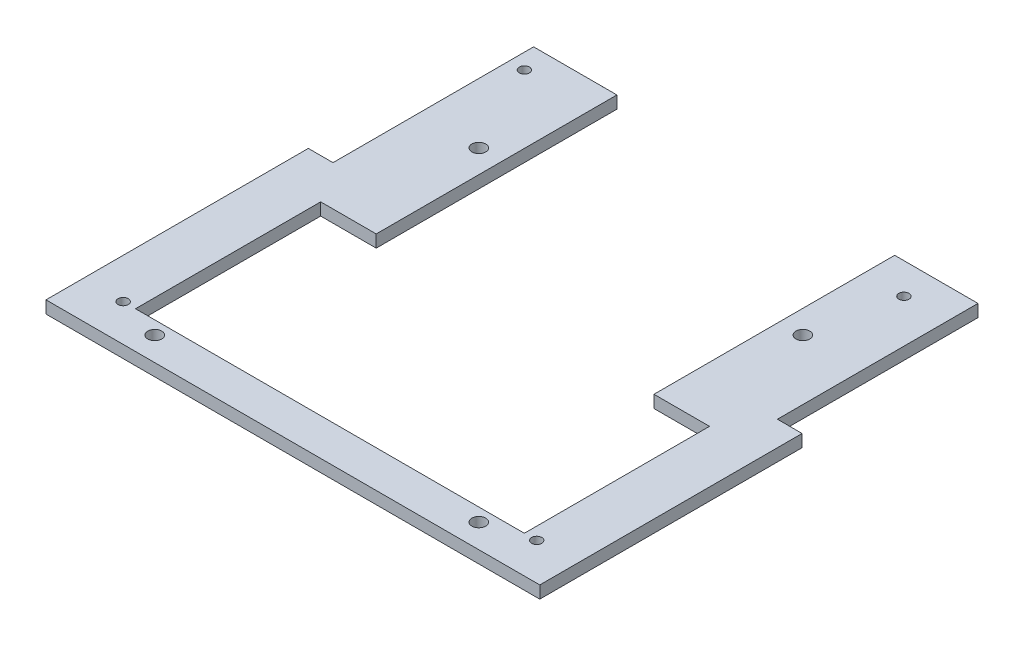
ISO-10303-21;
HEADER;
FILE_DESCRIPTION(('STEP AP214'),'2;1');
FILE_NAME('part.step','',(''),(''),'','','');
FILE_SCHEMA(('AUTOMOTIVE_DESIGN { 1 0 10303 214 1 1 1 1 }'));
ENDSEC;
DATA;
#1=APPLICATION_CONTEXT('core data for automotive mechanical design processes');
#2=APPLICATION_PROTOCOL_DEFINITION('international standard','automotive_design',2000,#1);
#3=PRODUCT_CONTEXT('',#1,'mechanical');
#4=PRODUCT('Part','Part','',(#3));
#5=PRODUCT_RELATED_PRODUCT_CATEGORY('part','',(#4));
#6=PRODUCT_DEFINITION_FORMATION('','',#4);
#7=PRODUCT_DEFINITION_CONTEXT('part definition',#1,'design');
#8=PRODUCT_DEFINITION('design','',#6,#7);
#9=PRODUCT_DEFINITION_SHAPE('','',#8);
#10=(LENGTH_UNIT() NAMED_UNIT(*) SI_UNIT(.MILLI.,.METRE.));
#11=(NAMED_UNIT(*) PLANE_ANGLE_UNIT() SI_UNIT($,.RADIAN.));
#12=(NAMED_UNIT(*) SI_UNIT($,.STERADIAN.) SOLID_ANGLE_UNIT());
#13=UNCERTAINTY_MEASURE_WITH_UNIT(LENGTH_MEASURE(1.E-05),#10,'distance_accuracy_value','');
#14=(GEOMETRIC_REPRESENTATION_CONTEXT(3) GLOBAL_UNCERTAINTY_ASSIGNED_CONTEXT((#13)) GLOBAL_UNIT_ASSIGNED_CONTEXT((#10,
#11,#12)) REPRESENTATION_CONTEXT('',''));
#15=CARTESIAN_POINT('',(0.,0.,0.));
#16=DIRECTION('',(0.,0.,1.));
#17=DIRECTION('',(1.,0.,0.));
#18=AXIS2_PLACEMENT_3D('',#15,#16,#17);
#19=CARTESIAN_POINT('',(72.,4.,0.));
#20=DIRECTION('',(1.,0.,0.));
#21=DIRECTION('',(0.,0.,-1.));
#22=AXIS2_PLACEMENT_3D('',#19,#20,#21);
#23=PLANE('',#22);
#24=DIRECTION('',(0.,0.,1.));
#25=VECTOR('',#24,1.);
#26=CARTESIAN_POINT('',(72.,0.,0.));
#27=LINE('',#26,#25);
#28=CARTESIAN_POINT('',(72.,0.,-75.));
#29=VERTEX_POINT('',#28);
#30=CARTESIAN_POINT('',(72.,0.,-10.));
#31=VERTEX_POINT('',#30);
#32=EDGE_CURVE('E216',#29,#31,#27,.T.);
#33=ORIENTED_EDGE('',*,*,#32,.F.);
#34=DIRECTION('',(0.,-1.,0.));
#35=VECTOR('',#34,1.);
#36=CARTESIAN_POINT('',(72.,4.,-75.));
#37=LINE('',#36,#35);
#38=CARTESIAN_POINT('',(72.,4.,-75.));
#39=VERTEX_POINT('',#38);
#40=EDGE_CURVE('E11',#39,#29,#37,.T.);
#41=ORIENTED_EDGE('',*,*,#40,.F.);
#42=DIRECTION('',(0.,0.,1.));
#43=VECTOR('',#42,1.);
#44=CARTESIAN_POINT('',(72.,4.,0.));
#45=LINE('',#44,#43);
#46=CARTESIAN_POINT('',(72.,4.,-10.));
#47=VERTEX_POINT('',#46);
#48=EDGE_CURVE('E409',#39,#47,#45,.T.);
#49=ORIENTED_EDGE('',*,*,#48,.T.);
#50=DIRECTION('',(0.,-1.,0.));
#51=VECTOR('',#50,1.);
#52=CARTESIAN_POINT('',(72.,4.,-10.));
#53=LINE('',#52,#51);
#54=EDGE_CURVE('E110',#47,#31,#53,.T.);
#55=ORIENTED_EDGE('',*,*,#54,.T.);
#56=EDGE_LOOP('',(#33,#41,#49,#55));
#57=FACE_BOUND('',#56,.T.);
#58=ADVANCED_FACE('F35',(#57),#23,.T.);
#59=CARTESIAN_POINT('',(0.,4.,-75.));
#60=DIRECTION('',(0.,0.,-1.));
#61=DIRECTION('',(-1.,0.,0.));
#62=AXIS2_PLACEMENT_3D('',#59,#60,#61);
#63=PLANE('',#62);
#64=DIRECTION('',(1.,0.,0.));
#65=VECTOR('',#64,1.);
#66=CARTESIAN_POINT('',(0.,0.,-75.));
#67=LINE('',#66,#65);
#68=CARTESIAN_POINT('',(45.,0.,-75.));
#69=VERTEX_POINT('',#68);
#70=EDGE_CURVE('E214',#69,#29,#67,.T.);
#71=ORIENTED_EDGE('',*,*,#70,.F.);
#72=DIRECTION('',(0.,-1.,0.));
#73=VECTOR('',#72,1.);
#74=CARTESIAN_POINT('',(45.,4.,-75.));
#75=LINE('',#74,#73);
#76=CARTESIAN_POINT('',(45.,4.,-75.));
#77=VERTEX_POINT('',#76);
#78=EDGE_CURVE('E44',#77,#69,#75,.T.);
#79=ORIENTED_EDGE('',*,*,#78,.F.);
#80=DIRECTION('',(1.,0.,0.));
#81=VECTOR('',#80,1.);
#82=CARTESIAN_POINT('',(0.,4.,-75.));
#83=LINE('',#82,#81);
#84=EDGE_CURVE('E408',#77,#39,#83,.T.);
#85=ORIENTED_EDGE('',*,*,#84,.T.);
#86=ORIENTED_EDGE('',*,*,#40,.T.);
#87=EDGE_LOOP('',(#71,#79,#85,#86));
#88=FACE_BOUND('',#87,.T.);
#89=ADVANCED_FACE('F215',(#88),#63,.T.);
#90=CARTESIAN_POINT('',(45.,4.,0.));
#91=DIRECTION('',(-1.,0.,0.));
#92=DIRECTION('',(0.,0.,1.));
#93=AXIS2_PLACEMENT_3D('',#90,#91,#92);
#94=PLANE('',#93);
#95=DIRECTION('',(0.,0.,-1.));
#96=VECTOR('',#95,1.);
#97=CARTESIAN_POINT('',(45.,0.,0.));
#98=LINE('',#97,#96);
#99=CARTESIAN_POINT('',(45.,0.,3.));
#100=VERTEX_POINT('',#99);
#101=EDGE_CURVE('E207',#100,#69,#98,.T.);
#102=ORIENTED_EDGE('',*,*,#101,.F.);
#103=DIRECTION('',(0.,-1.,0.));
#104=VECTOR('',#103,1.);
#105=CARTESIAN_POINT('',(45.,4.,3.));
#106=LINE('',#105,#104);
#107=CARTESIAN_POINT('',(45.,4.,3.));
#108=VERTEX_POINT('',#107);
#109=EDGE_CURVE('E200',#108,#100,#106,.T.);
#110=ORIENTED_EDGE('',*,*,#109,.F.);
#111=DIRECTION('',(0.,0.,-1.));
#112=VECTOR('',#111,1.);
#113=CARTESIAN_POINT('',(45.,4.,0.));
#114=LINE('',#113,#112);
#115=EDGE_CURVE('E209',#108,#77,#114,.T.);
#116=ORIENTED_EDGE('',*,*,#115,.T.);
#117=ORIENTED_EDGE('',*,*,#78,.T.);
#118=EDGE_LOOP('',(#102,#110,#116,#117));
#119=FACE_BOUND('',#118,.T.);
#120=ADVANCED_FACE('F205',(#119),#94,.T.);
#121=CARTESIAN_POINT('',(0.,4.,3.));
#122=DIRECTION('',(0.,0.,-1.));
#123=DIRECTION('',(-1.,0.,0.));
#124=AXIS2_PLACEMENT_3D('',#121,#122,#123);
#125=PLANE('',#124);
#126=DIRECTION('',(1.,0.,0.));
#127=VECTOR('',#126,1.);
#128=CARTESIAN_POINT('',(0.,0.,3.));
#129=LINE('',#128,#127);
#130=CARTESIAN_POINT('',(63.,0.,3.));
#131=VERTEX_POINT('',#130);
#132=EDGE_CURVE('E223',#100,#131,#129,.T.);
#133=ORIENTED_EDGE('',*,*,#132,.T.);
#134=DIRECTION('',(0.,-1.,0.));
#135=VECTOR('',#134,1.);
#136=CARTESIAN_POINT('',(63.,4.,3.));
#137=LINE('',#136,#135);
#138=CARTESIAN_POINT('',(63.,4.,3.));
#139=VERTEX_POINT('',#138);
#140=EDGE_CURVE('E198',#139,#131,#137,.T.);
#141=ORIENTED_EDGE('',*,*,#140,.F.);
#142=DIRECTION('',(1.,0.,0.));
#143=VECTOR('',#142,1.);
#144=CARTESIAN_POINT('',(0.,4.,3.));
#145=LINE('',#144,#143);
#146=EDGE_CURVE('E380',#108,#139,#145,.T.);
#147=ORIENTED_EDGE('',*,*,#146,.F.);
#148=ORIENTED_EDGE('',*,*,#109,.T.);
#149=EDGE_LOOP('',(#133,#141,#147,#148));
#150=FACE_BOUND('',#149,.T.);
#151=ADVANCED_FACE('F350',(#150),#125,.F.);
#152=CARTESIAN_POINT('',(63.,4.,0.));
#153=DIRECTION('',(-1.,0.,0.));
#154=DIRECTION('',(0.,0.,1.));
#155=AXIS2_PLACEMENT_3D('',#152,#153,#154);
#156=PLANE('',#155);
#157=DIRECTION('',(0.,0.,-1.));
#158=VECTOR('',#157,1.);
#159=CARTESIAN_POINT('',(63.,0.,0.));
#160=LINE('',#159,#158);
#161=CARTESIAN_POINT('',(63.,0.,63.));
#162=VERTEX_POINT('',#161);
#163=EDGE_CURVE('E225',#162,#131,#160,.T.);
#164=ORIENTED_EDGE('',*,*,#163,.F.);
#165=DIRECTION('',(0.,-1.,0.));
#166=VECTOR('',#165,1.);
#167=CARTESIAN_POINT('',(63.,4.,63.));
#168=LINE('',#167,#166);
#169=CARTESIAN_POINT('',(63.,4.,63.));
#170=VERTEX_POINT('',#169);
#171=EDGE_CURVE('E196',#170,#162,#168,.T.);
#172=ORIENTED_EDGE('',*,*,#171,.F.);
#173=DIRECTION('',(0.,0.,-1.));
#174=VECTOR('',#173,1.);
#175=CARTESIAN_POINT('',(63.,4.,0.));
#176=LINE('',#175,#174);
#177=EDGE_CURVE('E376',#170,#139,#176,.T.);
#178=ORIENTED_EDGE('',*,*,#177,.T.);
#179=ORIENTED_EDGE('',*,*,#140,.T.);
#180=EDGE_LOOP('',(#164,#172,#178,#179));
#181=FACE_BOUND('',#180,.T.);
#182=ADVANCED_FACE('F356',(#181),#156,.T.);
#183=CARTESIAN_POINT('',(0.,4.,63.));
#184=DIRECTION('',(0.,0.,-1.));
#185=DIRECTION('',(-1.,0.,0.));
#186=AXIS2_PLACEMENT_3D('',#183,#184,#185);
#187=PLANE('',#186);
#188=DIRECTION('',(1.,0.,0.));
#189=VECTOR('',#188,1.);
#190=CARTESIAN_POINT('',(0.,0.,63.));
#191=LINE('',#190,#189);
#192=CARTESIAN_POINT('',(-63.,0.,63.));
#193=VERTEX_POINT('',#192);
#194=EDGE_CURVE('E231',#193,#162,#191,.T.);
#195=ORIENTED_EDGE('',*,*,#194,.F.);
#196=DIRECTION('',(0.,-1.,0.));
#197=VECTOR('',#196,1.);
#198=CARTESIAN_POINT('',(-63.,4.,63.));
#199=LINE('',#198,#197);
#200=CARTESIAN_POINT('',(-63.,4.,63.));
#201=VERTEX_POINT('',#200);
#202=EDGE_CURVE('E194',#201,#193,#199,.T.);
#203=ORIENTED_EDGE('',*,*,#202,.F.);
#204=DIRECTION('',(1.,0.,0.));
#205=VECTOR('',#204,1.);
#206=CARTESIAN_POINT('',(0.,4.,63.));
#207=LINE('',#206,#205);
#208=EDGE_CURVE('E373',#201,#170,#207,.T.);
#209=ORIENTED_EDGE('',*,*,#208,.T.);
#210=ORIENTED_EDGE('',*,*,#171,.T.);
#211=EDGE_LOOP('',(#195,#203,#209,#210));
#212=FACE_BOUND('',#211,.T.);
#213=ADVANCED_FACE('F353',(#212),#187,.T.);
#214=CARTESIAN_POINT('',(-63.,4.,0.));
#215=DIRECTION('',(-1.,0.,0.));
#216=DIRECTION('',(0.,0.,1.));
#217=AXIS2_PLACEMENT_3D('',#214,#215,#216);
#218=PLANE('',#217);
#219=DIRECTION('',(0.,0.,-1.));
#220=VECTOR('',#219,1.);
#221=CARTESIAN_POINT('',(-63.,0.,0.));
#222=LINE('',#221,#220);
#223=CARTESIAN_POINT('',(-63.,0.,3.));
#224=VERTEX_POINT('',#223);
#225=EDGE_CURVE('E234',#193,#224,#222,.T.);
#226=ORIENTED_EDGE('',*,*,#225,.T.);
#227=DIRECTION('',(0.,-1.,0.));
#228=VECTOR('',#227,1.);
#229=CARTESIAN_POINT('',(-63.,4.,3.));
#230=LINE('',#229,#228);
#231=CARTESIAN_POINT('',(-63.,4.,3.));
#232=VERTEX_POINT('',#231);
#233=EDGE_CURVE('E191',#232,#224,#230,.T.);
#234=ORIENTED_EDGE('',*,*,#233,.F.);
#235=DIRECTION('',(0.,0.,-1.));
#236=VECTOR('',#235,1.);
#237=CARTESIAN_POINT('',(-63.,4.,0.));
#238=LINE('',#237,#236);
#239=EDGE_CURVE('E375',#201,#232,#238,.T.);
#240=ORIENTED_EDGE('',*,*,#239,.F.);
#241=ORIENTED_EDGE('',*,*,#202,.T.);
#242=EDGE_LOOP('',(#226,#234,#240,#241));
#243=FACE_BOUND('',#242,.T.);
#244=ADVANCED_FACE('F348',(#243),#218,.F.);
#245=CARTESIAN_POINT('',(-45.,0.,3.));
#246=VERTEX_POINT('',#245);
#247=EDGE_CURVE('E227',#224,#246,#129,.T.);
#248=ORIENTED_EDGE('',*,*,#247,.T.);
#249=DIRECTION('',(0.,-1.,0.));
#250=VECTOR('',#249,1.);
#251=CARTESIAN_POINT('',(-45.,4.,3.));
#252=LINE('',#251,#250);
#253=CARTESIAN_POINT('',(-45.,4.,3.));
#254=VERTEX_POINT('',#253);
#255=EDGE_CURVE('E188',#254,#246,#252,.T.);
#256=ORIENTED_EDGE('',*,*,#255,.F.);
#257=EDGE_CURVE('E378',#232,#254,#145,.T.);
#258=ORIENTED_EDGE('',*,*,#257,.F.);
#259=ORIENTED_EDGE('',*,*,#233,.T.);
#260=EDGE_LOOP('',(#248,#256,#258,#259));
#261=FACE_BOUND('',#260,.T.);
#262=ADVANCED_FACE('F344',(#261),#125,.F.);
#263=CARTESIAN_POINT('',(-45.,4.,0.));
#264=DIRECTION('',(-1.,0.,0.));
#265=DIRECTION('',(0.,0.,1.));
#266=AXIS2_PLACEMENT_3D('',#263,#264,#265);
#267=PLANE('',#266);
#268=DIRECTION('',(0.,0.,-1.));
#269=VECTOR('',#268,1.);
#270=CARTESIAN_POINT('',(-45.,0.,0.));
#271=LINE('',#270,#269);
#272=CARTESIAN_POINT('',(-45.,0.,-75.));
#273=VERTEX_POINT('',#272);
#274=EDGE_CURVE('E237',#246,#273,#271,.T.);
#275=ORIENTED_EDGE('',*,*,#274,.T.);
#276=DIRECTION('',(0.,-1.,0.));
#277=VECTOR('',#276,1.);
#278=CARTESIAN_POINT('',(-45.,4.,-75.));
#279=LINE('',#278,#277);
#280=CARTESIAN_POINT('',(-45.,4.,-75.));
#281=VERTEX_POINT('',#280);
#282=EDGE_CURVE('E186',#281,#273,#279,.T.);
#283=ORIENTED_EDGE('',*,*,#282,.F.);
#284=DIRECTION('',(0.,0.,-1.));
#285=VECTOR('',#284,1.);
#286=CARTESIAN_POINT('',(-45.,4.,0.));
#287=LINE('',#286,#285);
#288=EDGE_CURVE('E384',#254,#281,#287,.T.);
#289=ORIENTED_EDGE('',*,*,#288,.F.);
#290=ORIENTED_EDGE('',*,*,#255,.T.);
#291=EDGE_LOOP('',(#275,#283,#289,#290));
#292=FACE_BOUND('',#291,.T.);
#293=ADVANCED_FACE('F340',(#292),#267,.F.);
#294=CARTESIAN_POINT('',(-72.,0.,-75.));
#295=VERTEX_POINT('',#294);
#296=EDGE_CURVE('E218',#295,#273,#67,.T.);
#297=ORIENTED_EDGE('',*,*,#296,.F.);
#298=DIRECTION('',(0.,-1.,0.));
#299=VECTOR('',#298,1.);
#300=CARTESIAN_POINT('',(-72.,4.,-75.));
#301=LINE('',#300,#299);
#302=CARTESIAN_POINT('',(-72.,4.,-75.));
#303=VERTEX_POINT('',#302);
#304=EDGE_CURVE('E184',#303,#295,#301,.T.);
#305=ORIENTED_EDGE('',*,*,#304,.F.);
#306=EDGE_CURVE('E386',#303,#281,#83,.T.);
#307=ORIENTED_EDGE('',*,*,#306,.T.);
#308=ORIENTED_EDGE('',*,*,#282,.T.);
#309=EDGE_LOOP('',(#297,#305,#307,#308));
#310=FACE_BOUND('',#309,.T.);
#311=ADVANCED_FACE('F273',(#310),#63,.T.);
#312=CARTESIAN_POINT('',(-72.,4.,0.));
#313=DIRECTION('',(1.,0.,0.));
#314=DIRECTION('',(0.,0.,-1.));
#315=AXIS2_PLACEMENT_3D('',#312,#313,#314);
#316=PLANE('',#315);
#317=DIRECTION('',(0.,0.,1.));
#318=VECTOR('',#317,1.);
#319=CARTESIAN_POINT('',(-72.,0.,0.));
#320=LINE('',#319,#318);
#321=CARTESIAN_POINT('',(-72.,0.,-10.));
#322=VERTEX_POINT('',#321);
#323=EDGE_CURVE('E240',#295,#322,#320,.T.);
#324=ORIENTED_EDGE('',*,*,#323,.T.);
#325=DIRECTION('',(0.,-1.,0.));
#326=VECTOR('',#325,1.);
#327=CARTESIAN_POINT('',(-72.,4.,-10.));
#328=LINE('',#327,#326);
#329=CARTESIAN_POINT('',(-72.,4.,-10.));
#330=VERTEX_POINT('',#329);
#331=EDGE_CURVE('E182',#330,#322,#328,.T.);
#332=ORIENTED_EDGE('',*,*,#331,.F.);
#333=DIRECTION('',(0.,0.,1.));
#334=VECTOR('',#333,1.);
#335=CARTESIAN_POINT('',(-72.,4.,0.));
#336=LINE('',#335,#334);
#337=EDGE_CURVE('E387',#303,#330,#336,.T.);
#338=ORIENTED_EDGE('',*,*,#337,.F.);
#339=ORIENTED_EDGE('',*,*,#304,.T.);
#340=EDGE_LOOP('',(#324,#332,#338,#339));
#341=FACE_BOUND('',#340,.T.);
#342=ADVANCED_FACE('F334',(#341),#316,.F.);
#343=CARTESIAN_POINT('',(0.,4.,-10.));
#344=DIRECTION('',(0.,0.,-1.));
#345=DIRECTION('',(-1.,0.,0.));
#346=AXIS2_PLACEMENT_3D('',#343,#344,#345);
#347=PLANE('',#346);
#348=DIRECTION('',(1.,0.,0.));
#349=VECTOR('',#348,1.);
#350=CARTESIAN_POINT('',(0.,0.,-10.));
#351=LINE('',#350,#349);
#352=CARTESIAN_POINT('',(-80.,0.,-10.));
#353=VERTEX_POINT('',#352);
#354=EDGE_CURVE('E243',#353,#322,#351,.T.);
#355=ORIENTED_EDGE('',*,*,#354,.F.);
#356=DIRECTION('',(0.,-1.,0.));
#357=VECTOR('',#356,1.);
#358=CARTESIAN_POINT('',(-80.,4.,-10.));
#359=LINE('',#358,#357);
#360=CARTESIAN_POINT('',(-80.,4.,-10.));
#361=VERTEX_POINT('',#360);
#362=EDGE_CURVE('E176',#361,#353,#359,.T.);
#363=ORIENTED_EDGE('',*,*,#362,.F.);
#364=DIRECTION('',(1.,0.,0.));
#365=VECTOR('',#364,1.);
#366=CARTESIAN_POINT('',(0.,4.,-10.));
#367=LINE('',#366,#365);
#368=EDGE_CURVE('E389',#361,#330,#367,.T.);
#369=ORIENTED_EDGE('',*,*,#368,.T.);
#370=ORIENTED_EDGE('',*,*,#331,.T.);
#371=EDGE_LOOP('',(#355,#363,#369,#370));
#372=FACE_BOUND('',#371,.T.);
#373=ADVANCED_FACE('F330',(#372),#347,.T.);
#374=CARTESIAN_POINT('',(-80.,4.,0.));
#375=DIRECTION('',(-1.,0.,0.));
#376=DIRECTION('',(0.,0.,1.));
#377=AXIS2_PLACEMENT_3D('',#374,#375,#376);
#378=PLANE('',#377);
#379=DIRECTION('',(0.,0.,-1.));
#380=VECTOR('',#379,1.);
#381=CARTESIAN_POINT('',(-80.,0.,0.));
#382=LINE('',#381,#380);
#383=CARTESIAN_POINT('',(-80.,0.,75.));
#384=VERTEX_POINT('',#383);
#385=EDGE_CURVE('E246',#384,#353,#382,.T.);
#386=ORIENTED_EDGE('',*,*,#385,.F.);
#387=DIRECTION('',(0.,-1.,0.));
#388=VECTOR('',#387,1.);
#389=CARTESIAN_POINT('',(-80.,4.,75.));
#390=LINE('',#389,#388);
#391=CARTESIAN_POINT('',(-80.,4.,75.));
#392=VERTEX_POINT('',#391);
#393=EDGE_CURVE('E174',#392,#384,#390,.T.);
#394=ORIENTED_EDGE('',*,*,#393,.F.);
#395=DIRECTION('',(0.,0.,-1.));
#396=VECTOR('',#395,1.);
#397=CARTESIAN_POINT('',(-80.,4.,0.));
#398=LINE('',#397,#396);
#399=EDGE_CURVE('E168',#392,#361,#398,.T.);
#400=ORIENTED_EDGE('',*,*,#399,.T.);
#401=ORIENTED_EDGE('',*,*,#362,.T.);
#402=EDGE_LOOP('',(#386,#394,#400,#401));
#403=FACE_BOUND('',#402,.T.);
#404=ADVANCED_FACE('F327',(#403),#378,.T.);
#405=CARTESIAN_POINT('',(0.,4.,75.));
#406=DIRECTION('',(0.,0.,-1.));
#407=DIRECTION('',(-1.,0.,0.));
#408=AXIS2_PLACEMENT_3D('',#405,#406,#407);
#409=PLANE('',#408);
#410=DIRECTION('',(1.,0.,0.));
#411=VECTOR('',#410,1.);
#412=CARTESIAN_POINT('',(0.,0.,75.));
#413=LINE('',#412,#411);
#414=CARTESIAN_POINT('',(80.,0.,75.));
#415=VERTEX_POINT('',#414);
#416=EDGE_CURVE('E173',#384,#415,#413,.T.);
#417=ORIENTED_EDGE('',*,*,#416,.T.);
#418=DIRECTION('',(0.,-1.,0.));
#419=VECTOR('',#418,1.);
#420=CARTESIAN_POINT('',(80.,4.,75.));
#421=LINE('',#420,#419);
#422=CARTESIAN_POINT('',(80.,4.,75.));
#423=VERTEX_POINT('',#422);
#424=EDGE_CURVE('E158',#423,#415,#421,.T.);
#425=ORIENTED_EDGE('',*,*,#424,.F.);
#426=DIRECTION('',(1.,0.,0.));
#427=VECTOR('',#426,1.);
#428=CARTESIAN_POINT('',(0.,4.,75.));
#429=LINE('',#428,#427);
#430=EDGE_CURVE('E161',#392,#423,#429,.T.);
#431=ORIENTED_EDGE('',*,*,#430,.F.);
#432=ORIENTED_EDGE('',*,*,#393,.T.);
#433=EDGE_LOOP('',(#417,#425,#431,#432));
#434=FACE_BOUND('',#433,.T.);
#435=ADVANCED_FACE('F171',(#434),#409,.F.);
#436=CARTESIAN_POINT('',(80.,4.,0.));
#437=DIRECTION('',(-1.,0.,0.));
#438=DIRECTION('',(0.,0.,1.));
#439=AXIS2_PLACEMENT_3D('',#436,#437,#438);
#440=PLANE('',#439);
#441=DIRECTION('',(0.,0.,-1.));
#442=VECTOR('',#441,1.);
#443=CARTESIAN_POINT('',(80.,0.,0.));
#444=LINE('',#443,#442);
#445=CARTESIAN_POINT('',(80.,0.,-10.));
#446=VERTEX_POINT('',#445);
#447=EDGE_CURVE('E250',#415,#446,#444,.T.);
#448=ORIENTED_EDGE('',*,*,#447,.T.);
#449=DIRECTION('',(0.,-1.,0.));
#450=VECTOR('',#449,1.);
#451=CARTESIAN_POINT('',(80.,4.,-10.));
#452=LINE('',#451,#450);
#453=CARTESIAN_POINT('',(80.,4.,-10.));
#454=VERTEX_POINT('',#453);
#455=EDGE_CURVE('E160',#454,#446,#452,.T.);
#456=ORIENTED_EDGE('',*,*,#455,.F.);
#457=DIRECTION('',(0.,0.,-1.));
#458=VECTOR('',#457,1.);
#459=CARTESIAN_POINT('',(80.,4.,0.));
#460=LINE('',#459,#458);
#461=EDGE_CURVE('E153',#423,#454,#460,.T.);
#462=ORIENTED_EDGE('',*,*,#461,.F.);
#463=ORIENTED_EDGE('',*,*,#424,.T.);
#464=EDGE_LOOP('',(#448,#456,#462,#463));
#465=FACE_BOUND('',#464,.T.);
#466=ADVANCED_FACE('F156',(#465),#440,.F.);
#467=CARTESIAN_POINT('',(-67.,4.,63.));
#468=DIRECTION('',(0.,-1.,0.));
#469=DIRECTION('',(0.,0.,-1.));
#470=AXIS2_PLACEMENT_3D('',#467,#468,#469);
#471=CYLINDRICAL_SURFACE('',#470,1.65);
#472=CARTESIAN_POINT('',(-67.,4.,63.));
#473=DIRECTION('',(0.,1.,0.));
#474=DIRECTION('',(0.,0.,1.));
#475=AXIS2_PLACEMENT_3D('',#472,#473,#474);
#476=CIRCLE('',#475,1.65);
#477=CARTESIAN_POINT('',(-67.,4.,64.65));
#478=VERTEX_POINT('',#477);
#479=EDGE_CURVE('E413',#478,#478,#476,.T.);
#480=ORIENTED_EDGE('',*,*,#479,.T.);
#481=EDGE_LOOP('',(#480));
#482=FACE_BOUND('',#481,.T.);
#483=CARTESIAN_POINT('',(-67.,0.,63.));
#484=DIRECTION('',(0.,1.,0.));
#485=DIRECTION('',(0.,0.,1.));
#486=AXIS2_PLACEMENT_3D('',#483,#484,#485);
#487=CIRCLE('',#486,1.65);
#488=CARTESIAN_POINT('',(-67.,0.,64.65));
#489=VERTEX_POINT('',#488);
#490=EDGE_CURVE('E265',#489,#489,#487,.T.);
#491=ORIENTED_EDGE('',*,*,#490,.F.);
#492=EDGE_LOOP('',(#491));
#493=FACE_BOUND('',#492,.T.);
#494=ADVANCED_FACE('F277',(#482,#493),#471,.F.);
#495=CARTESIAN_POINT('',(67.,4.,63.));
#496=DIRECTION('',(0.,-1.,0.));
#497=DIRECTION('',(0.,0.,-1.));
#498=AXIS2_PLACEMENT_3D('',#495,#496,#497);
#499=CYLINDRICAL_SURFACE('',#498,1.65);
#500=CARTESIAN_POINT('',(67.,4.,63.));
#501=DIRECTION('',(0.,1.,0.));
#502=DIRECTION('',(0.,0.,1.));
#503=AXIS2_PLACEMENT_3D('',#500,#501,#502);
#504=CIRCLE('',#503,1.65);
#505=CARTESIAN_POINT('',(67.,4.,64.65));
#506=VERTEX_POINT('',#505);
#507=EDGE_CURVE('E416',#506,#506,#504,.T.);
#508=ORIENTED_EDGE('',*,*,#507,.T.);
#509=EDGE_LOOP('',(#508));
#510=FACE_BOUND('',#509,.T.);
#511=CARTESIAN_POINT('',(67.,0.,63.));
#512=DIRECTION('',(0.,1.,0.));
#513=DIRECTION('',(0.,0.,1.));
#514=AXIS2_PLACEMENT_3D('',#511,#512,#513);
#515=CIRCLE('',#514,1.65);
#516=CARTESIAN_POINT('',(67.,0.,64.65));
#517=VERTEX_POINT('',#516);
#518=EDGE_CURVE('E262',#517,#517,#515,.T.);
#519=ORIENTED_EDGE('',*,*,#518,.F.);
#520=EDGE_LOOP('',(#519));
#521=FACE_BOUND('',#520,.T.);
#522=ADVANCED_FACE('F280',(#510,#521),#499,.F.);
#523=CARTESIAN_POINT('',(58.,4.,-65.));
#524=DIRECTION('',(0.,-1.,0.));
#525=DIRECTION('',(0.,0.,-1.));
#526=AXIS2_PLACEMENT_3D('',#523,#524,#525);
#527=CYLINDRICAL_SURFACE('',#526,1.65);
#528=CARTESIAN_POINT('',(58.,4.,-65.));
#529=DIRECTION('',(0.,1.,0.));
#530=DIRECTION('',(0.,0.,1.));
#531=AXIS2_PLACEMENT_3D('',#528,#529,#530);
#532=CIRCLE('',#531,1.65);
#533=CARTESIAN_POINT('',(58.,4.,-63.35));
#534=VERTEX_POINT('',#533);
#535=EDGE_CURVE('E295',#534,#534,#532,.T.);
#536=ORIENTED_EDGE('',*,*,#535,.T.);
#537=EDGE_LOOP('',(#536));
#538=FACE_BOUND('',#537,.T.);
#539=CARTESIAN_POINT('',(58.,0.,-65.));
#540=DIRECTION('',(0.,1.,0.));
#541=DIRECTION('',(0.,0.,1.));
#542=AXIS2_PLACEMENT_3D('',#539,#540,#541);
#543=CIRCLE('',#542,1.65);
#544=CARTESIAN_POINT('',(58.,0.,-63.35));
#545=VERTEX_POINT('',#544);
#546=EDGE_CURVE('E258',#545,#545,#543,.T.);
#547=ORIENTED_EDGE('',*,*,#546,.F.);
#548=EDGE_LOOP('',(#547));
#549=FACE_BOUND('',#548,.T.);
#550=ADVANCED_FACE('F283',(#538,#549),#527,.F.);
#551=CARTESIAN_POINT('',(-67.,4.,-67.));
#552=DIRECTION('',(0.,-1.,0.));
#553=DIRECTION('',(0.,0.,-1.));
#554=AXIS2_PLACEMENT_3D('',#551,#552,#553);
#555=CYLINDRICAL_SURFACE('',#554,1.65);
#556=CARTESIAN_POINT('',(-67.,4.,-67.));
#557=DIRECTION('',(0.,1.,0.));
#558=DIRECTION('',(0.,0.,1.));
#559=AXIS2_PLACEMENT_3D('',#556,#557,#558);
#560=CIRCLE('',#559,1.65);
#561=CARTESIAN_POINT('',(-67.,4.,-65.35));
#562=VERTEX_POINT('',#561);
#563=EDGE_CURVE('E252',#562,#562,#560,.T.);
#564=ORIENTED_EDGE('',*,*,#563,.T.);
#565=EDGE_LOOP('',(#564));
#566=FACE_BOUND('',#565,.T.);
#567=CARTESIAN_POINT('',(-67.,0.,-67.));
#568=DIRECTION('',(0.,1.,0.));
#569=DIRECTION('',(0.,0.,1.));
#570=AXIS2_PLACEMENT_3D('',#567,#568,#569);
#571=CIRCLE('',#570,1.65);
#572=CARTESIAN_POINT('',(-67.,0.,-65.35));
#573=VERTEX_POINT('',#572);
#574=EDGE_CURVE('E255',#573,#573,#571,.T.);
#575=ORIENTED_EDGE('',*,*,#574,.F.);
#576=EDGE_LOOP('',(#575));
#577=FACE_BOUND('',#576,.T.);
#578=ADVANCED_FACE('F37',(#566,#577),#555,.F.);
#579=CARTESIAN_POINT('',(0.,4.,-10.));
#580=DIRECTION('',(0.,0.,1.));
#581=DIRECTION('',(1.,0.,0.));
#582=AXIS2_PLACEMENT_3D('',#579,#580,#581);
#583=PLANE('',#582);
#584=DIRECTION('',(-1.,0.,0.));
#585=VECTOR('',#584,1.);
#586=CARTESIAN_POINT('',(0.,0.,-10.));
#587=LINE('',#586,#585);
#588=EDGE_CURVE('E103',#446,#31,#587,.T.);
#589=ORIENTED_EDGE('',*,*,#588,.T.);
#590=ORIENTED_EDGE('',*,*,#54,.F.);
#591=DIRECTION('',(-1.,0.,0.));
#592=VECTOR('',#591,1.);
#593=CARTESIAN_POINT('',(0.,4.,-10.));
#594=LINE('',#593,#592);
#595=EDGE_CURVE('E52',#454,#47,#594,.T.);
#596=ORIENTED_EDGE('',*,*,#595,.F.);
#597=ORIENTED_EDGE('',*,*,#455,.T.);
#598=EDGE_LOOP('',(#589,#590,#596,#597));
#599=FACE_BOUND('',#598,.T.);
#600=ADVANCED_FACE('F290',(#599),#583,.F.);
#601=CARTESIAN_POINT('',(0.,4.,0.));
#602=DIRECTION('',(0.,1.,0.));
#603=DIRECTION('',(0.,0.,1.));
#604=AXIS2_PLACEMENT_3D('',#601,#602,#603);
#605=PLANE('',#604);
#606=CARTESIAN_POINT('',(-52.5,4.,67.2598376579209));
#607=DIRECTION('',(0.,1.,0.));
#608=DIRECTION('',(0.,0.,1.));
#609=AXIS2_PLACEMENT_3D('',#606,#607,#608);
#610=CIRCLE('',#609,2.25);
#611=CARTESIAN_POINT('',(-52.5,4.,69.5098376579209));
#612=VERTEX_POINT('',#611);
#613=EDGE_CURVE('E435',#612,#612,#610,.T.);
#614=ORIENTED_EDGE('',*,*,#613,.F.);
#615=EDGE_LOOP('',(#614));
#616=FACE_BOUND('',#615,.T.);
#617=CARTESIAN_POINT('',(52.5,4.,-37.7401623420791));
#618=DIRECTION('',(0.,1.,0.));
#619=DIRECTION('',(0.,0.,1.));
#620=AXIS2_PLACEMENT_3D('',#617,#618,#619);
#621=CIRCLE('',#620,2.25);
#622=CARTESIAN_POINT('',(52.5,4.,-35.4901623420791));
#623=VERTEX_POINT('',#622);
#624=EDGE_CURVE('E428',#623,#623,#621,.T.);
#625=ORIENTED_EDGE('',*,*,#624,.F.);
#626=EDGE_LOOP('',(#625));
#627=FACE_BOUND('',#626,.T.);
#628=CARTESIAN_POINT('',(-52.5,4.,-37.7401623420791));
#629=DIRECTION('',(0.,1.,0.));
#630=DIRECTION('',(0.,0.,1.));
#631=AXIS2_PLACEMENT_3D('',#628,#629,#630);
#632=CIRCLE('',#631,2.25);
#633=CARTESIAN_POINT('',(-52.5,4.,-35.4901623420791));
#634=VERTEX_POINT('',#633);
#635=EDGE_CURVE('E439',#634,#634,#632,.T.);
#636=ORIENTED_EDGE('',*,*,#635,.F.);
#637=EDGE_LOOP('',(#636));
#638=FACE_BOUND('',#637,.T.);
#639=CARTESIAN_POINT('',(52.5,4.,67.2598376579209));
#640=DIRECTION('',(0.,1.,0.));
#641=DIRECTION('',(0.,0.,1.));
#642=AXIS2_PLACEMENT_3D('',#639,#640,#641);
#643=CIRCLE('',#642,2.25);
#644=CARTESIAN_POINT('',(52.5,4.,69.5098376579209));
#645=VERTEX_POINT('',#644);
#646=EDGE_CURVE('E422',#645,#645,#643,.T.);
#647=ORIENTED_EDGE('',*,*,#646,.F.);
#648=EDGE_LOOP('',(#647));
#649=FACE_BOUND('',#648,.T.);
#650=ORIENTED_EDGE('',*,*,#563,.F.);
#651=EDGE_LOOP('',(#650));
#652=FACE_BOUND('',#651,.T.);
#653=ORIENTED_EDGE('',*,*,#535,.F.);
#654=EDGE_LOOP('',(#653));
#655=FACE_BOUND('',#654,.T.);
#656=ORIENTED_EDGE('',*,*,#507,.F.);
#657=EDGE_LOOP('',(#656));
#658=FACE_BOUND('',#657,.T.);
#659=ORIENTED_EDGE('',*,*,#479,.F.);
#660=EDGE_LOOP('',(#659));
#661=FACE_BOUND('',#660,.T.);
#662=ORIENTED_EDGE('',*,*,#48,.F.);
#663=ORIENTED_EDGE('',*,*,#84,.F.);
#664=ORIENTED_EDGE('',*,*,#115,.F.);
#665=ORIENTED_EDGE('',*,*,#146,.T.);
#666=ORIENTED_EDGE('',*,*,#177,.F.);
#667=ORIENTED_EDGE('',*,*,#208,.F.);
#668=ORIENTED_EDGE('',*,*,#239,.T.);
#669=ORIENTED_EDGE('',*,*,#257,.T.);
#670=ORIENTED_EDGE('',*,*,#288,.T.);
#671=ORIENTED_EDGE('',*,*,#306,.F.);
#672=ORIENTED_EDGE('',*,*,#337,.T.);
#673=ORIENTED_EDGE('',*,*,#368,.F.);
#674=ORIENTED_EDGE('',*,*,#399,.F.);
#675=ORIENTED_EDGE('',*,*,#430,.T.);
#676=ORIENTED_EDGE('',*,*,#461,.T.);
#677=ORIENTED_EDGE('',*,*,#595,.T.);
#678=EDGE_LOOP('',(#662,#663,#664,#665,#666,#667,#668,#669,#670,#671,#672,#673,#674,#675,#676,#677));
#679=FACE_BOUND('',#678,.T.);
#680=ADVANCED_FACE('F165',(#616,#627,#638,#649,#652,#655,#658,#661,#679),#605,.T.);
#681=CARTESIAN_POINT('',(0.,0.,0.));
#682=DIRECTION('',(0.,1.,0.));
#683=DIRECTION('',(0.,0.,1.));
#684=AXIS2_PLACEMENT_3D('',#681,#682,#683);
#685=PLANE('',#684);
#686=CARTESIAN_POINT('',(-52.5,0.,67.2598376579209));
#687=DIRECTION('',(0.,1.,0.));
#688=DIRECTION('',(0.,0.,1.));
#689=AXIS2_PLACEMENT_3D('',#686,#687,#688);
#690=CIRCLE('',#689,2.25);
#691=CARTESIAN_POINT('',(-52.5,0.,69.5098376579209));
#692=VERTEX_POINT('',#691);
#693=EDGE_CURVE('E425',#692,#692,#690,.T.);
#694=ORIENTED_EDGE('',*,*,#693,.T.);
#695=EDGE_LOOP('',(#694));
#696=FACE_BOUND('',#695,.T.);
#697=CARTESIAN_POINT('',(52.5,0.,-37.7401623420791));
#698=DIRECTION('',(0.,1.,0.));
#699=DIRECTION('',(0.,0.,1.));
#700=AXIS2_PLACEMENT_3D('',#697,#698,#699);
#701=CIRCLE('',#700,2.25);
#702=CARTESIAN_POINT('',(52.5,0.,-35.4901623420791));
#703=VERTEX_POINT('',#702);
#704=EDGE_CURVE('E431',#703,#703,#701,.T.);
#705=ORIENTED_EDGE('',*,*,#704,.T.);
#706=EDGE_LOOP('',(#705));
#707=FACE_BOUND('',#706,.T.);
#708=CARTESIAN_POINT('',(-52.5,0.,-37.7401623420791));
#709=DIRECTION('',(0.,1.,0.));
#710=DIRECTION('',(0.,0.,1.));
#711=AXIS2_PLACEMENT_3D('',#708,#709,#710);
#712=CIRCLE('',#711,2.25);
#713=CARTESIAN_POINT('',(-52.5,0.,-35.4901623420791));
#714=VERTEX_POINT('',#713);
#715=EDGE_CURVE('E432',#714,#714,#712,.T.);
#716=ORIENTED_EDGE('',*,*,#715,.T.);
#717=EDGE_LOOP('',(#716));
#718=FACE_BOUND('',#717,.T.);
#719=CARTESIAN_POINT('',(52.5,0.,67.2598376579209));
#720=DIRECTION('',(0.,1.,0.));
#721=DIRECTION('',(0.,0.,1.));
#722=AXIS2_PLACEMENT_3D('',#719,#720,#721);
#723=CIRCLE('',#722,2.25);
#724=CARTESIAN_POINT('',(52.5,0.,69.5098376579209));
#725=VERTEX_POINT('',#724);
#726=EDGE_CURVE('E259',#725,#725,#723,.T.);
#727=ORIENTED_EDGE('',*,*,#726,.T.);
#728=EDGE_LOOP('',(#727));
#729=FACE_BOUND('',#728,.T.);
#730=ORIENTED_EDGE('',*,*,#574,.T.);
#731=EDGE_LOOP('',(#730));
#732=FACE_BOUND('',#731,.T.);
#733=ORIENTED_EDGE('',*,*,#546,.T.);
#734=EDGE_LOOP('',(#733));
#735=FACE_BOUND('',#734,.T.);
#736=ORIENTED_EDGE('',*,*,#518,.T.);
#737=EDGE_LOOP('',(#736));
#738=FACE_BOUND('',#737,.T.);
#739=ORIENTED_EDGE('',*,*,#490,.T.);
#740=EDGE_LOOP('',(#739));
#741=FACE_BOUND('',#740,.T.);
#742=ORIENTED_EDGE('',*,*,#32,.T.);
#743=ORIENTED_EDGE('',*,*,#588,.F.);
#744=ORIENTED_EDGE('',*,*,#447,.F.);
#745=ORIENTED_EDGE('',*,*,#416,.F.);
#746=ORIENTED_EDGE('',*,*,#385,.T.);
#747=ORIENTED_EDGE('',*,*,#354,.T.);
#748=ORIENTED_EDGE('',*,*,#323,.F.);
#749=ORIENTED_EDGE('',*,*,#296,.T.);
#750=ORIENTED_EDGE('',*,*,#274,.F.);
#751=ORIENTED_EDGE('',*,*,#247,.F.);
#752=ORIENTED_EDGE('',*,*,#225,.F.);
#753=ORIENTED_EDGE('',*,*,#194,.T.);
#754=ORIENTED_EDGE('',*,*,#163,.T.);
#755=ORIENTED_EDGE('',*,*,#132,.F.);
#756=ORIENTED_EDGE('',*,*,#101,.T.);
#757=ORIENTED_EDGE('',*,*,#70,.T.);
#758=EDGE_LOOP('',(#742,#743,#744,#745,#746,#747,#748,#749,#750,#751,#752,#753,#754,#755,#756,#757));
#759=FACE_BOUND('',#758,.T.);
#760=ADVANCED_FACE('F220',(#696,#707,#718,#729,#732,#735,#738,#741,#759),#685,.F.);
#761=CARTESIAN_POINT('',(52.5,0.,67.2598376579209));
#762=DIRECTION('',(0.,1.,0.));
#763=DIRECTION('',(0.,0.,1.));
#764=AXIS2_PLACEMENT_3D('',#761,#762,#763);
#765=CYLINDRICAL_SURFACE('',#764,2.25);
#766=ORIENTED_EDGE('',*,*,#726,.F.);
#767=EDGE_LOOP('',(#766));
#768=FACE_BOUND('',#767,.T.);
#769=ORIENTED_EDGE('',*,*,#646,.T.);
#770=EDGE_LOOP('',(#769));
#771=FACE_BOUND('',#770,.T.);
#772=ADVANCED_FACE('F300',(#768,#771),#765,.F.);
#773=CARTESIAN_POINT('',(-52.5,0.,-37.7401623420791));
#774=DIRECTION('',(0.,1.,0.));
#775=DIRECTION('',(0.,0.,1.));
#776=AXIS2_PLACEMENT_3D('',#773,#774,#775);
#777=CYLINDRICAL_SURFACE('',#776,2.25);
#778=ORIENTED_EDGE('',*,*,#715,.F.);
#779=EDGE_LOOP('',(#778));
#780=FACE_BOUND('',#779,.T.);
#781=ORIENTED_EDGE('',*,*,#635,.T.);
#782=EDGE_LOOP('',(#781));
#783=FACE_BOUND('',#782,.T.);
#784=ADVANCED_FACE('F312',(#780,#783),#777,.F.);
#785=CARTESIAN_POINT('',(52.5,0.,-37.7401623420791));
#786=DIRECTION('',(0.,1.,0.));
#787=DIRECTION('',(0.,0.,1.));
#788=AXIS2_PLACEMENT_3D('',#785,#786,#787);
#789=CYLINDRICAL_SURFACE('',#788,2.25);
#790=ORIENTED_EDGE('',*,*,#704,.F.);
#791=EDGE_LOOP('',(#790));
#792=FACE_BOUND('',#791,.T.);
#793=ORIENTED_EDGE('',*,*,#624,.T.);
#794=EDGE_LOOP('',(#793));
#795=FACE_BOUND('',#794,.T.);
#796=ADVANCED_FACE('F449',(#792,#795),#789,.F.);
#797=CARTESIAN_POINT('',(-52.5,0.,67.2598376579209));
#798=DIRECTION('',(0.,1.,0.));
#799=DIRECTION('',(0.,0.,1.));
#800=AXIS2_PLACEMENT_3D('',#797,#798,#799);
#801=CYLINDRICAL_SURFACE('',#800,2.25);
#802=ORIENTED_EDGE('',*,*,#693,.F.);
#803=EDGE_LOOP('',(#802));
#804=FACE_BOUND('',#803,.T.);
#805=ORIENTED_EDGE('',*,*,#613,.T.);
#806=EDGE_LOOP('',(#805));
#807=FACE_BOUND('',#806,.T.);
#808=ADVANCED_FACE('F469',(#804,#807),#801,.F.);
#809=CLOSED_SHELL('',(#58,#89,#120,#151,#182,#213,#244,#262,#293,#311,#342,#373,#404,#435,#466,
#494,#522,#550,#578,#600,#680,#760,#772,#784,#796,#808));
#810=MANIFOLD_SOLID_BREP('B2',#809);
#811=ADVANCED_BREP_SHAPE_REPRESENTATION('',(#18,#810),#14);
#812=SHAPE_DEFINITION_REPRESENTATION(#9,#811);
ENDSEC;
END-ISO-10303-21;
